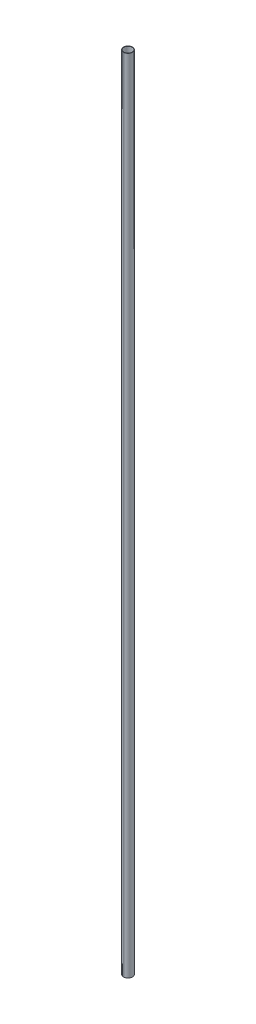
ISO-10303-21;
HEADER;
FILE_DESCRIPTION(('STEP AP214'),'2;1');
FILE_NAME('part.step','',(''),(''),'','','');
FILE_SCHEMA(('AUTOMOTIVE_DESIGN { 1 0 10303 214 1 1 1 1 }'));
ENDSEC;
DATA;
#1=APPLICATION_CONTEXT('core data for automotive mechanical design processes');
#2=APPLICATION_PROTOCOL_DEFINITION('international standard','automotive_design',2000,#1);
#3=PRODUCT_CONTEXT('',#1,'mechanical');
#4=PRODUCT('Part','Part','',(#3));
#5=PRODUCT_RELATED_PRODUCT_CATEGORY('part','',(#4));
#6=PRODUCT_DEFINITION_FORMATION('','',#4);
#7=PRODUCT_DEFINITION_CONTEXT('part definition',#1,'design');
#8=PRODUCT_DEFINITION('design','',#6,#7);
#9=PRODUCT_DEFINITION_SHAPE('','',#8);
#10=(LENGTH_UNIT() NAMED_UNIT(*) SI_UNIT(.MILLI.,.METRE.));
#11=(NAMED_UNIT(*) PLANE_ANGLE_UNIT() SI_UNIT($,.RADIAN.));
#12=(NAMED_UNIT(*) SI_UNIT($,.STERADIAN.) SOLID_ANGLE_UNIT());
#13=UNCERTAINTY_MEASURE_WITH_UNIT(LENGTH_MEASURE(1.E-05),#10,'distance_accuracy_value','');
#14=(GEOMETRIC_REPRESENTATION_CONTEXT(3) GLOBAL_UNCERTAINTY_ASSIGNED_CONTEXT((#13)) GLOBAL_UNIT_ASSIGNED_CONTEXT((#10,
#11,#12)) REPRESENTATION_CONTEXT('',''));
#15=CARTESIAN_POINT('',(0.,0.,0.));
#16=DIRECTION('',(0.,0.,1.));
#17=DIRECTION('',(1.,0.,0.));
#18=AXIS2_PLACEMENT_3D('',#15,#16,#17);
#19=CARTESIAN_POINT('',(0.,2438.4,0.));
#20=DIRECTION('',(0.,-1.,0.));
#21=DIRECTION('',(0.,0.,-1.));
#22=AXIS2_PLACEMENT_3D('',#19,#20,#21);
#23=CYLINDRICAL_SURFACE('',#22,13.716);
#24=DIRECTION('',(0.,-1.,0.));
#25=VECTOR('',#24,1.);
#26=CARTESIAN_POINT('',(-1.27,2438.4,13.6570771397104));
#27=LINE('',#26,#25);
#28=CARTESIAN_POINT('',(-1.27,2438.4,13.6570771397104));
#29=VERTEX_POINT('',#28);
#30=CARTESIAN_POINT('',(-1.27,0.,13.6570771397104));
#31=VERTEX_POINT('',#30);
#32=EDGE_CURVE('E13',#29,#31,#27,.T.);
#33=ORIENTED_EDGE('',*,*,#32,.F.);
#34=CARTESIAN_POINT('',(0.,2438.4,0.));
#35=DIRECTION('',(0.,1.,0.));
#36=DIRECTION('',(0.,0.,1.));
#37=AXIS2_PLACEMENT_3D('',#34,#35,#36);
#38=CIRCLE('',#37,13.716);
#39=CARTESIAN_POINT('',(-1.27,2438.4,-13.6570771397104));
#40=VERTEX_POINT('',#39);
#41=EDGE_CURVE('E124',#40,#29,#38,.T.);
#42=ORIENTED_EDGE('',*,*,#41,.F.);
#43=DIRECTION('',(0.,-1.,0.));
#44=VECTOR('',#43,1.);
#45=CARTESIAN_POINT('',(-1.27,2438.4,-13.6570771397104));
#46=LINE('',#45,#44);
#47=CARTESIAN_POINT('',(-1.27,0.,-13.6570771397104));
#48=VERTEX_POINT('',#47);
#49=EDGE_CURVE('E71',#48,#40,#46,.F.);
#50=ORIENTED_EDGE('',*,*,#49,.F.);
#51=CARTESIAN_POINT('',(0.,0.,0.));
#52=DIRECTION('',(0.,1.,0.));
#53=DIRECTION('',(0.,0.,1.));
#54=AXIS2_PLACEMENT_3D('',#51,#52,#53);
#55=CIRCLE('',#54,13.716);
#56=EDGE_CURVE('E129',#48,#31,#55,.T.);
#57=ORIENTED_EDGE('',*,*,#56,.T.);
#58=EDGE_LOOP('',(#33,#42,#50,#57));
#59=FACE_BOUND('',#58,.T.);
#60=ADVANCED_FACE('F62',(#59),#23,.T.);
#61=CARTESIAN_POINT('',(1.27,2438.4,13.6570771397104));
#62=VERTEX_POINT('',#61);
#63=EDGE_CURVE('E122',#29,#62,#38,.T.);
#64=ORIENTED_EDGE('',*,*,#63,.F.);
#65=ORIENTED_EDGE('',*,*,#32,.T.);
#66=CARTESIAN_POINT('',(-1.26818607724485,0.,13.6572456986569));
#67=VERTEX_POINT('',#66);
#68=EDGE_CURVE('E111',#31,#67,#55,.T.);
#69=ORIENTED_EDGE('',*,*,#68,.T.);
#70=CARTESIAN_POINT('',(1.26818607724484,0.,13.6572456986569));
#71=VERTEX_POINT('',#70);
#72=EDGE_CURVE('E107',#67,#71,#55,.T.);
#73=ORIENTED_EDGE('',*,*,#72,.T.);
#74=CARTESIAN_POINT('',(1.27,0.,13.6570771397104));
#75=VERTEX_POINT('',#74);
#76=EDGE_CURVE('E110',#71,#75,#55,.T.);
#77=ORIENTED_EDGE('',*,*,#76,.T.);
#78=DIRECTION('',(0.,-1.,0.));
#79=VECTOR('',#78,1.);
#80=CARTESIAN_POINT('',(1.27,2438.4,13.6570771397104));
#81=LINE('',#80,#79);
#82=EDGE_CURVE('E137',#75,#62,#81,.F.);
#83=ORIENTED_EDGE('',*,*,#82,.T.);
#84=EDGE_LOOP('',(#64,#65,#69,#73,#77,#83));
#85=FACE_BOUND('',#84,.T.);
#86=ADVANCED_FACE('F109',(#85),#23,.T.);
#87=DIRECTION('',(0.,-1.,0.));
#88=VECTOR('',#87,1.);
#89=CARTESIAN_POINT('',(1.27,2438.4,-13.6570771397104));
#90=LINE('',#89,#88);
#91=CARTESIAN_POINT('',(1.27,2438.4,-13.6570771397104));
#92=VERTEX_POINT('',#91);
#93=CARTESIAN_POINT('',(1.27,0.,-13.6570771397104));
#94=VERTEX_POINT('',#93);
#95=EDGE_CURVE('E133',#92,#94,#90,.T.);
#96=ORIENTED_EDGE('',*,*,#95,.F.);
#97=EDGE_CURVE('E126',#62,#92,#38,.T.);
#98=ORIENTED_EDGE('',*,*,#97,.F.);
#99=ORIENTED_EDGE('',*,*,#82,.F.);
#100=EDGE_CURVE('E116',#75,#94,#55,.T.);
#101=ORIENTED_EDGE('',*,*,#100,.T.);
#102=EDGE_LOOP('',(#96,#98,#99,#101));
#103=FACE_BOUND('',#102,.T.);
#104=ADVANCED_FACE('F135',(#103),#23,.T.);
#105=CARTESIAN_POINT('',(0.,2438.4,0.));
#106=DIRECTION('',(0.,1.,0.));
#107=DIRECTION('',(0.,0.,1.));
#108=AXIS2_PLACEMENT_3D('',#105,#106,#107);
#109=PLANE('',#108);
#110=ORIENTED_EDGE('',*,*,#97,.T.);
#111=EDGE_CURVE('E144',#92,#40,#38,.T.);
#112=ORIENTED_EDGE('',*,*,#111,.T.);
#113=ORIENTED_EDGE('',*,*,#41,.T.);
#114=ORIENTED_EDGE('',*,*,#63,.T.);
#115=EDGE_LOOP('',(#110,#112,#113,#114));
#116=FACE_BOUND('',#115,.T.);
#117=CARTESIAN_POINT('',(0.,2438.4,0.));
#118=DIRECTION('',(0.,1.,0.));
#119=DIRECTION('',(0.,0.,1.));
#120=AXIS2_PLACEMENT_3D('',#117,#118,#119);
#121=CIRCLE('',#120,12.7);
#122=CARTESIAN_POINT('',(0.,2438.4,12.7));
#123=VERTEX_POINT('',#122);
#124=EDGE_CURVE('E114',#123,#123,#121,.T.);
#125=ORIENTED_EDGE('',*,*,#124,.F.);
#126=EDGE_LOOP('',(#125));
#127=FACE_BOUND('',#126,.T.);
#128=ADVANCED_FACE('F162',(#116,#127),#109,.T.);
#129=CARTESIAN_POINT('',(0.,0.,0.));
#130=DIRECTION('',(0.,1.,0.));
#131=DIRECTION('',(0.,0.,1.));
#132=AXIS2_PLACEMENT_3D('',#129,#130,#131);
#133=PLANE('',#132);
#134=ORIENTED_EDGE('',*,*,#76,.F.);
#135=ORIENTED_EDGE('',*,*,#72,.F.);
#136=ORIENTED_EDGE('',*,*,#68,.F.);
#137=ORIENTED_EDGE('',*,*,#56,.F.);
#138=EDGE_CURVE('E127',#94,#48,#55,.T.);
#139=ORIENTED_EDGE('',*,*,#138,.F.);
#140=ORIENTED_EDGE('',*,*,#100,.F.);
#141=EDGE_LOOP('',(#134,#135,#136,#137,#139,#140));
#142=FACE_BOUND('',#141,.T.);
#143=CARTESIAN_POINT('',(0.,0.,0.));
#144=DIRECTION('',(0.,1.,0.));
#145=DIRECTION('',(0.,0.,1.));
#146=AXIS2_PLACEMENT_3D('',#143,#144,#145);
#147=CIRCLE('',#146,12.7);
#148=CARTESIAN_POINT('',(0.,0.,12.7));
#149=VERTEX_POINT('',#148);
#150=EDGE_CURVE('E153',#149,#149,#147,.T.);
#151=ORIENTED_EDGE('',*,*,#150,.T.);
#152=EDGE_LOOP('',(#151));
#153=FACE_BOUND('',#152,.T.);
#154=ADVANCED_FACE('F118',(#142,#153),#133,.F.);
#155=ORIENTED_EDGE('',*,*,#138,.T.);
#156=ORIENTED_EDGE('',*,*,#49,.T.);
#157=ORIENTED_EDGE('',*,*,#111,.F.);
#158=ORIENTED_EDGE('',*,*,#95,.T.);
#159=EDGE_LOOP('',(#155,#156,#157,#158));
#160=FACE_BOUND('',#159,.T.);
#161=ADVANCED_FACE('F64',(#160),#23,.T.);
#162=CARTESIAN_POINT('',(0.,2438.4,0.));
#163=DIRECTION('',(0.,-1.,0.));
#164=DIRECTION('',(0.,0.,-1.));
#165=AXIS2_PLACEMENT_3D('',#162,#163,#164);
#166=CYLINDRICAL_SURFACE('',#165,12.7);
#167=ORIENTED_EDGE('',*,*,#124,.T.);
#168=EDGE_LOOP('',(#167));
#169=FACE_BOUND('',#168,.T.);
#170=ORIENTED_EDGE('',*,*,#150,.F.);
#171=EDGE_LOOP('',(#170));
#172=FACE_BOUND('',#171,.T.);
#173=ADVANCED_FACE('F159',(#169,#172),#166,.F.);
#174=CLOSED_SHELL('',(#60,#86,#104,#128,#154,#161,#173));
#175=MANIFOLD_SOLID_BREP('B2',#174);
#176=ADVANCED_BREP_SHAPE_REPRESENTATION('',(#18,#175),#14);
#177=SHAPE_DEFINITION_REPRESENTATION(#9,#176);
ENDSEC;
END-ISO-10303-21;
